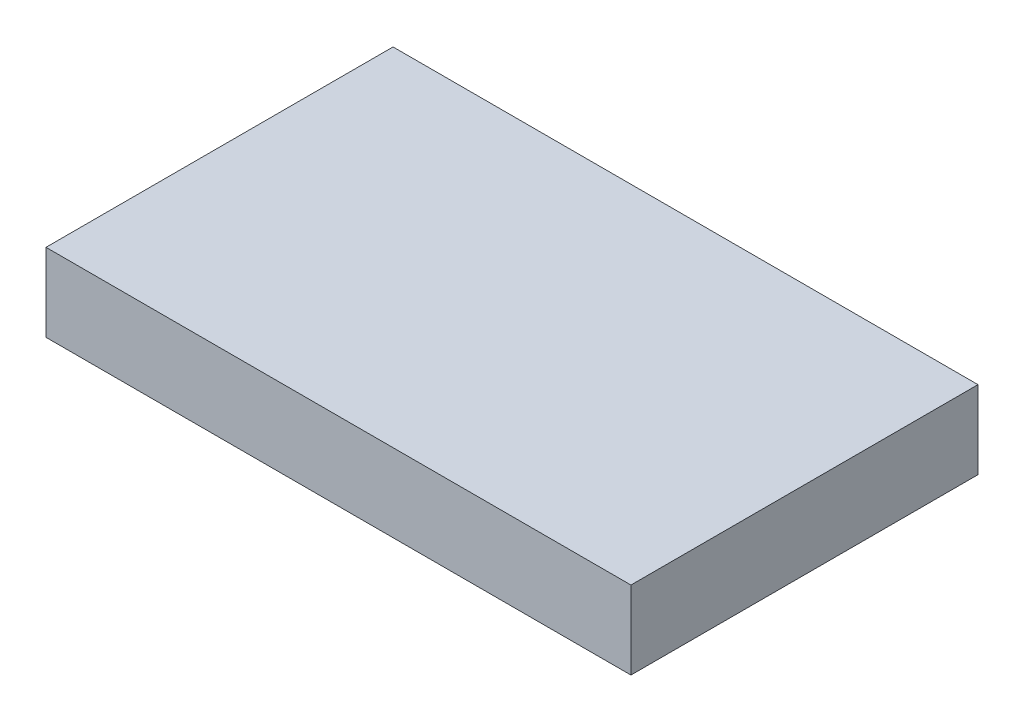
ISO-10303-21;
HEADER;
FILE_DESCRIPTION(('STEP AP214'),'2;1');
FILE_NAME('part.step','',(''),(''),'','','');
FILE_SCHEMA(('AUTOMOTIVE_DESIGN { 1 0 10303 214 1 1 1 1 }'));
ENDSEC;
DATA;
#1=APPLICATION_CONTEXT('core data for automotive mechanical design processes');
#2=APPLICATION_PROTOCOL_DEFINITION('international standard','automotive_design',2000,#1);
#3=PRODUCT_CONTEXT('',#1,'mechanical');
#4=PRODUCT('Part','Part','',(#3));
#5=PRODUCT_RELATED_PRODUCT_CATEGORY('part','',(#4));
#6=PRODUCT_DEFINITION_FORMATION('','',#4);
#7=PRODUCT_DEFINITION_CONTEXT('part definition',#1,'design');
#8=PRODUCT_DEFINITION('design','',#6,#7);
#9=PRODUCT_DEFINITION_SHAPE('','',#8);
#10=(LENGTH_UNIT() NAMED_UNIT(*) SI_UNIT(.MILLI.,.METRE.));
#11=(NAMED_UNIT(*) PLANE_ANGLE_UNIT() SI_UNIT($,.RADIAN.));
#12=(NAMED_UNIT(*) SI_UNIT($,.STERADIAN.) SOLID_ANGLE_UNIT());
#13=UNCERTAINTY_MEASURE_WITH_UNIT(LENGTH_MEASURE(1.E-05),#10,'distance_accuracy_value','');
#14=(GEOMETRIC_REPRESENTATION_CONTEXT(3) GLOBAL_UNCERTAINTY_ASSIGNED_CONTEXT((#13)) GLOBAL_UNIT_ASSIGNED_CONTEXT((#10,
#11,#12)) REPRESENTATION_CONTEXT('',''));
#15=CARTESIAN_POINT('',(0.,0.,0.));
#16=DIRECTION('',(0.,0.,1.));
#17=DIRECTION('',(1.,0.,0.));
#18=AXIS2_PLACEMENT_3D('',#15,#16,#17);
#19=CARTESIAN_POINT('',(0.,20.,0.));
#20=DIRECTION('',(1.,0.,0.));
#21=DIRECTION('',(0.,0.,-1.));
#22=AXIS2_PLACEMENT_3D('',#19,#20,#21);
#23=PLANE('',#22);
#24=DIRECTION('',(0.,0.,1.));
#25=VECTOR('',#24,1.);
#26=CARTESIAN_POINT('',(0.,0.,0.));
#27=LINE('',#26,#25);
#28=CARTESIAN_POINT('',(0.,0.,-89.));
#29=VERTEX_POINT('',#28);
#30=CARTESIAN_POINT('',(0.,0.,0.));
#31=VERTEX_POINT('',#30);
#32=EDGE_CURVE('E100',#29,#31,#27,.T.);
#33=ORIENTED_EDGE('',*,*,#32,.T.);
#34=DIRECTION('',(0.,-1.,0.));
#35=VECTOR('',#34,1.);
#36=CARTESIAN_POINT('',(0.,20.,0.));
#37=LINE('',#36,#35);
#38=CARTESIAN_POINT('',(0.,20.,0.));
#39=VERTEX_POINT('',#38);
#40=EDGE_CURVE('E11',#39,#31,#37,.T.);
#41=ORIENTED_EDGE('',*,*,#40,.F.);
#42=DIRECTION('',(0.,0.,1.));
#43=VECTOR('',#42,1.);
#44=CARTESIAN_POINT('',(0.,20.,0.));
#45=LINE('',#44,#43);
#46=CARTESIAN_POINT('',(0.,20.,-89.));
#47=VERTEX_POINT('',#46);
#48=EDGE_CURVE('E88',#47,#39,#45,.T.);
#49=ORIENTED_EDGE('',*,*,#48,.F.);
#50=DIRECTION('',(0.,-1.,0.));
#51=VECTOR('',#50,1.);
#52=CARTESIAN_POINT('',(0.,20.,-89.));
#53=LINE('',#52,#51);
#54=EDGE_CURVE('E96',#47,#29,#53,.T.);
#55=ORIENTED_EDGE('',*,*,#54,.T.);
#56=EDGE_LOOP('',(#33,#41,#49,#55));
#57=FACE_BOUND('',#56,.T.);
#58=ADVANCED_FACE('F37',(#57),#23,.F.);
#59=CARTESIAN_POINT('',(0.,20.,0.));
#60=DIRECTION('',(0.,0.,-1.));
#61=DIRECTION('',(-1.,0.,0.));
#62=AXIS2_PLACEMENT_3D('',#59,#60,#61);
#63=PLANE('',#62);
#64=DIRECTION('',(1.,0.,0.));
#65=VECTOR('',#64,1.);
#66=CARTESIAN_POINT('',(0.,0.,0.));
#67=LINE('',#66,#65);
#68=CARTESIAN_POINT('',(150.,0.,0.));
#69=VERTEX_POINT('',#68);
#70=EDGE_CURVE('E92',#31,#69,#67,.T.);
#71=ORIENTED_EDGE('',*,*,#70,.T.);
#72=DIRECTION('',(0.,-1.,0.));
#73=VECTOR('',#72,1.);
#74=CARTESIAN_POINT('',(150.,20.,0.));
#75=LINE('',#74,#73);
#76=CARTESIAN_POINT('',(150.,20.,0.));
#77=VERTEX_POINT('',#76);
#78=EDGE_CURVE('E45',#77,#69,#75,.T.);
#79=ORIENTED_EDGE('',*,*,#78,.F.);
#80=DIRECTION('',(1.,0.,0.));
#81=VECTOR('',#80,1.);
#82=CARTESIAN_POINT('',(0.,20.,0.));
#83=LINE('',#82,#81);
#84=EDGE_CURVE('E83',#39,#77,#83,.T.);
#85=ORIENTED_EDGE('',*,*,#84,.F.);
#86=ORIENTED_EDGE('',*,*,#40,.T.);
#87=EDGE_LOOP('',(#71,#79,#85,#86));
#88=FACE_BOUND('',#87,.T.);
#89=ADVANCED_FACE('F91',(#88),#63,.F.);
#90=CARTESIAN_POINT('',(150.,20.,0.));
#91=DIRECTION('',(-1.,0.,0.));
#92=DIRECTION('',(0.,0.,1.));
#93=AXIS2_PLACEMENT_3D('',#90,#91,#92);
#94=PLANE('',#93);
#95=DIRECTION('',(0.,0.,-1.));
#96=VECTOR('',#95,1.);
#97=CARTESIAN_POINT('',(150.,0.,0.));
#98=LINE('',#97,#96);
#99=CARTESIAN_POINT('',(150.,0.,-89.));
#100=VERTEX_POINT('',#99);
#101=EDGE_CURVE('E70',#69,#100,#98,.T.);
#102=ORIENTED_EDGE('',*,*,#101,.T.);
#103=DIRECTION('',(0.,-1.,0.));
#104=VECTOR('',#103,1.);
#105=CARTESIAN_POINT('',(150.,20.,-89.));
#106=LINE('',#105,#104);
#107=CARTESIAN_POINT('',(150.,20.,-89.));
#108=VERTEX_POINT('',#107);
#109=EDGE_CURVE('E93',#108,#100,#106,.T.);
#110=ORIENTED_EDGE('',*,*,#109,.F.);
#111=DIRECTION('',(0.,0.,-1.));
#112=VECTOR('',#111,1.);
#113=CARTESIAN_POINT('',(150.,20.,0.));
#114=LINE('',#113,#112);
#115=EDGE_CURVE('E86',#77,#108,#114,.T.);
#116=ORIENTED_EDGE('',*,*,#115,.F.);
#117=ORIENTED_EDGE('',*,*,#78,.T.);
#118=EDGE_LOOP('',(#102,#110,#116,#117));
#119=FACE_BOUND('',#118,.T.);
#120=ADVANCED_FACE('F94',(#119),#94,.F.);
#121=CARTESIAN_POINT('',(0.,20.,-89.));
#122=DIRECTION('',(0.,0.,1.));
#123=DIRECTION('',(1.,0.,0.));
#124=AXIS2_PLACEMENT_3D('',#121,#122,#123);
#125=PLANE('',#124);
#126=DIRECTION('',(-1.,0.,0.));
#127=VECTOR('',#126,1.);
#128=CARTESIAN_POINT('',(0.,0.,-89.));
#129=LINE('',#128,#127);
#130=EDGE_CURVE('E76',#100,#29,#129,.T.);
#131=ORIENTED_EDGE('',*,*,#130,.T.);
#132=ORIENTED_EDGE('',*,*,#54,.F.);
#133=DIRECTION('',(-1.,0.,0.));
#134=VECTOR('',#133,1.);
#135=CARTESIAN_POINT('',(0.,20.,-89.));
#136=LINE('',#135,#134);
#137=EDGE_CURVE('E53',#108,#47,#136,.T.);
#138=ORIENTED_EDGE('',*,*,#137,.F.);
#139=ORIENTED_EDGE('',*,*,#109,.T.);
#140=EDGE_LOOP('',(#131,#132,#138,#139));
#141=FACE_BOUND('',#140,.T.);
#142=ADVANCED_FACE('F107',(#141),#125,.F.);
#143=CARTESIAN_POINT('',(0.,20.,0.));
#144=DIRECTION('',(0.,-1.,0.));
#145=DIRECTION('',(0.,0.,-1.));
#146=AXIS2_PLACEMENT_3D('',#143,#144,#145);
#147=PLANE('',#146);
#148=ORIENTED_EDGE('',*,*,#48,.T.);
#149=ORIENTED_EDGE('',*,*,#84,.T.);
#150=ORIENTED_EDGE('',*,*,#115,.T.);
#151=ORIENTED_EDGE('',*,*,#137,.T.);
#152=EDGE_LOOP('',(#148,#149,#150,#151));
#153=FACE_BOUND('',#152,.T.);
#154=ADVANCED_FACE('F84',(#153),#147,.F.);
#155=CARTESIAN_POINT('',(0.,0.,0.));
#156=DIRECTION('',(0.,-1.,0.));
#157=DIRECTION('',(0.,0.,-1.));
#158=AXIS2_PLACEMENT_3D('',#155,#156,#157);
#159=PLANE('',#158);
#160=ORIENTED_EDGE('',*,*,#32,.F.);
#161=ORIENTED_EDGE('',*,*,#130,.F.);
#162=ORIENTED_EDGE('',*,*,#101,.F.);
#163=ORIENTED_EDGE('',*,*,#70,.F.);
#164=EDGE_LOOP('',(#160,#161,#162,#163));
#165=FACE_BOUND('',#164,.T.);
#166=ADVANCED_FACE('F110',(#165),#159,.T.);
#167=CLOSED_SHELL('',(#58,#89,#120,#142,#154,#166));
#168=MANIFOLD_SOLID_BREP('B2',#167);
#169=ADVANCED_BREP_SHAPE_REPRESENTATION('',(#18,#168),#14);
#170=SHAPE_DEFINITION_REPRESENTATION(#9,#169);
ENDSEC;
END-ISO-10303-21;
